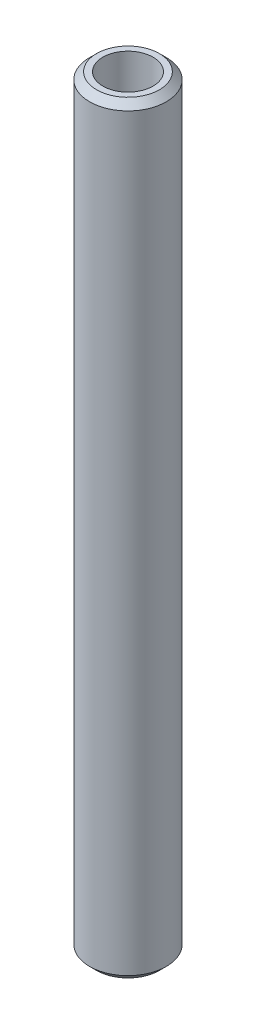
ISO-10303-21;
HEADER;
FILE_DESCRIPTION(('STEP AP214'),'2;1');
FILE_NAME('part.step','',(''),(''),'','','');
FILE_SCHEMA(('AUTOMOTIVE_DESIGN { 1 0 10303 214 1 1 1 1 }'));
ENDSEC;
DATA;
#1=APPLICATION_CONTEXT('core data for automotive mechanical design processes');
#2=APPLICATION_PROTOCOL_DEFINITION('international standard','automotive_design',2000,#1);
#3=PRODUCT_CONTEXT('',#1,'mechanical');
#4=PRODUCT('Part','Part','',(#3));
#5=PRODUCT_RELATED_PRODUCT_CATEGORY('part','',(#4));
#6=PRODUCT_DEFINITION_FORMATION('','',#4);
#7=PRODUCT_DEFINITION_CONTEXT('part definition',#1,'design');
#8=PRODUCT_DEFINITION('design','',#6,#7);
#9=PRODUCT_DEFINITION_SHAPE('','',#8);
#10=(LENGTH_UNIT() NAMED_UNIT(*) SI_UNIT(.MILLI.,.METRE.));
#11=(NAMED_UNIT(*) PLANE_ANGLE_UNIT() SI_UNIT($,.RADIAN.));
#12=(NAMED_UNIT(*) SI_UNIT($,.STERADIAN.) SOLID_ANGLE_UNIT());
#13=UNCERTAINTY_MEASURE_WITH_UNIT(LENGTH_MEASURE(1.E-05),#10,'distance_accuracy_value','');
#14=(GEOMETRIC_REPRESENTATION_CONTEXT(3) GLOBAL_UNCERTAINTY_ASSIGNED_CONTEXT((#13)) GLOBAL_UNIT_ASSIGNED_CONTEXT((#10,
#11,#12)) REPRESENTATION_CONTEXT('',''));
#15=CARTESIAN_POINT('',(0.,0.,0.));
#16=DIRECTION('',(0.,0.,1.));
#17=DIRECTION('',(1.,0.,0.));
#18=AXIS2_PLACEMENT_3D('',#15,#16,#17);
#19=CARTESIAN_POINT('',(0.,198.892360065524,0.));
#20=DIRECTION('',(0.,-1.,0.));
#21=DIRECTION('',(0.,0.,-1.));
#22=AXIS2_PLACEMENT_3D('',#19,#20,#21);
#23=CYLINDRICAL_SURFACE('',#22,10.);
#24=CARTESIAN_POINT('',(0.,197.082765831659,0.));
#25=DIRECTION('',(0.,1.,0.));
#26=DIRECTION('',(0.,0.,1.));
#27=AXIS2_PLACEMENT_3D('',#24,#25,#26);
#28=CIRCLE('',#27,10.);
#29=CARTESIAN_POINT('',(0.,197.082765831659,10.));
#30=VERTEX_POINT('',#29);
#31=EDGE_CURVE('E50',#30,#30,#28,.F.);
#32=ORIENTED_EDGE('',*,*,#31,.T.);
#33=EDGE_LOOP('',(#32));
#34=FACE_BOUND('',#33,.T.);
#35=CARTESIAN_POINT('',(0.,1.80959423386431,0.));
#36=DIRECTION('',(0.,1.,0.));
#37=DIRECTION('',(0.,0.,1.));
#38=AXIS2_PLACEMENT_3D('',#35,#36,#37);
#39=CIRCLE('',#38,10.);
#40=CARTESIAN_POINT('',(0.,1.80959423386431,10.));
#41=VERTEX_POINT('',#40);
#42=EDGE_CURVE('E51',#41,#41,#39,.T.);
#43=ORIENTED_EDGE('',*,*,#42,.T.);
#44=EDGE_LOOP('',(#43));
#45=FACE_BOUND('',#44,.T.);
#46=ADVANCED_FACE('F39',(#34,#45),#23,.T.);
#47=CARTESIAN_POINT('',(0.,198.892360065524,0.));
#48=DIRECTION('',(0.,1.,0.));
#49=DIRECTION('',(0.,0.,1.));
#50=AXIS2_PLACEMENT_3D('',#47,#48,#49);
#51=PLANE('',#50);
#52=CARTESIAN_POINT('',(0.,198.892360065524,0.));
#53=DIRECTION('',(0.,1.,0.));
#54=DIRECTION('',(0.,0.,1.));
#55=AXIS2_PLACEMENT_3D('',#52,#53,#54);
#56=CIRCLE('',#55,8.19040576613567);
#57=CARTESIAN_POINT('',(0.,198.892360065524,8.19040576613567));
#58=VERTEX_POINT('',#57);
#59=EDGE_CURVE('E54',#58,#58,#56,.T.);
#60=ORIENTED_EDGE('',*,*,#59,.T.);
#61=EDGE_LOOP('',(#60));
#62=FACE_BOUND('',#61,.T.);
#63=CARTESIAN_POINT('',(0.,198.892360065524,0.));
#64=DIRECTION('',(0.,1.,0.));
#65=DIRECTION('',(0.,0.,1.));
#66=AXIS2_PLACEMENT_3D('',#63,#64,#65);
#67=CIRCLE('',#66,6.54961320651119);
#68=CARTESIAN_POINT('',(0.,198.892360065524,6.54961320651119));
#69=VERTEX_POINT('',#68);
#70=EDGE_CURVE('E58',#69,#69,#67,.T.);
#71=ORIENTED_EDGE('',*,*,#70,.F.);
#72=EDGE_LOOP('',(#71));
#73=FACE_BOUND('',#72,.T.);
#74=ADVANCED_FACE('F69',(#62,#73),#51,.T.);
#75=CARTESIAN_POINT('',(0.,0.,0.));
#76=DIRECTION('',(0.,1.,0.));
#77=DIRECTION('',(0.,0.,1.));
#78=AXIS2_PLACEMENT_3D('',#75,#76,#77);
#79=PLANE('',#78);
#80=CARTESIAN_POINT('',(0.,0.,0.));
#81=DIRECTION('',(0.,1.,0.));
#82=DIRECTION('',(0.,0.,1.));
#83=AXIS2_PLACEMENT_3D('',#80,#81,#82);
#84=CIRCLE('',#83,8.19040576613567);
#85=CARTESIAN_POINT('',(0.,0.,8.19040576613567));
#86=VERTEX_POINT('',#85);
#87=EDGE_CURVE('E10',#86,#86,#84,.F.);
#88=ORIENTED_EDGE('',*,*,#87,.T.);
#89=EDGE_LOOP('',(#88));
#90=FACE_BOUND('',#89,.T.);
#91=CARTESIAN_POINT('',(0.,0.,0.));
#92=DIRECTION('',(0.,1.,0.));
#93=DIRECTION('',(0.,0.,1.));
#94=AXIS2_PLACEMENT_3D('',#91,#92,#93);
#95=CIRCLE('',#94,6.54961320651119);
#96=CARTESIAN_POINT('',(0.,0.,6.54961320651119));
#97=VERTEX_POINT('',#96);
#98=EDGE_CURVE('E63',#97,#97,#95,.T.);
#99=ORIENTED_EDGE('',*,*,#98,.T.);
#100=EDGE_LOOP('',(#99));
#101=FACE_BOUND('',#100,.T.);
#102=ADVANCED_FACE('F75',(#90,#101),#79,.F.);
#103=CARTESIAN_POINT('',(0.,198.892360065524,0.));
#104=DIRECTION('',(0.,-1.,0.));
#105=DIRECTION('',(0.,0.,-1.));
#106=AXIS2_PLACEMENT_3D('',#103,#104,#105);
#107=CYLINDRICAL_SURFACE('',#106,6.54961320651119);
#108=ORIENTED_EDGE('',*,*,#70,.T.);
#109=EDGE_LOOP('',(#108));
#110=FACE_BOUND('',#109,.T.);
#111=ORIENTED_EDGE('',*,*,#98,.F.);
#112=EDGE_LOOP('',(#111));
#113=FACE_BOUND('',#112,.T.);
#114=ADVANCED_FACE('F70',(#110,#113),#107,.F.);
#115=CARTESIAN_POINT('',(0.,198.892360065524,0.));
#116=DIRECTION('',(0.,-1.,0.));
#117=DIRECTION('',(0.,0.,-1.));
#118=AXIS2_PLACEMENT_3D('',#115,#116,#117);
#119=CONICAL_SURFACE('',#118,8.19040576613567,0.785398163397446);
#120=ORIENTED_EDGE('',*,*,#31,.F.);
#121=EDGE_LOOP('',(#120));
#122=FACE_BOUND('',#121,.T.);
#123=ORIENTED_EDGE('',*,*,#59,.F.);
#124=EDGE_LOOP('',(#123));
#125=FACE_BOUND('',#124,.T.);
#126=ADVANCED_FACE('F81',(#122,#125),#119,.T.);
#127=CARTESIAN_POINT('',(0.,1.80959423386431,0.));
#128=DIRECTION('',(0.,1.,0.));
#129=DIRECTION('',(0.,0.,1.));
#130=AXIS2_PLACEMENT_3D('',#127,#128,#129);
#131=CONICAL_SURFACE('',#130,10.,0.785398163397454);
#132=ORIENTED_EDGE('',*,*,#87,.F.);
#133=EDGE_LOOP('',(#132));
#134=FACE_BOUND('',#133,.T.);
#135=ORIENTED_EDGE('',*,*,#42,.F.);
#136=EDGE_LOOP('',(#135));
#137=FACE_BOUND('',#136,.T.);
#138=ADVANCED_FACE('F45',(#134,#137),#131,.T.);
#139=CLOSED_SHELL('',(#46,#74,#102,#114,#126,#138));
#140=MANIFOLD_SOLID_BREP('B2',#139);
#141=ADVANCED_BREP_SHAPE_REPRESENTATION('',(#18,#140),#14);
#142=SHAPE_DEFINITION_REPRESENTATION(#9,#141);
ENDSEC;
END-ISO-10303-21;
